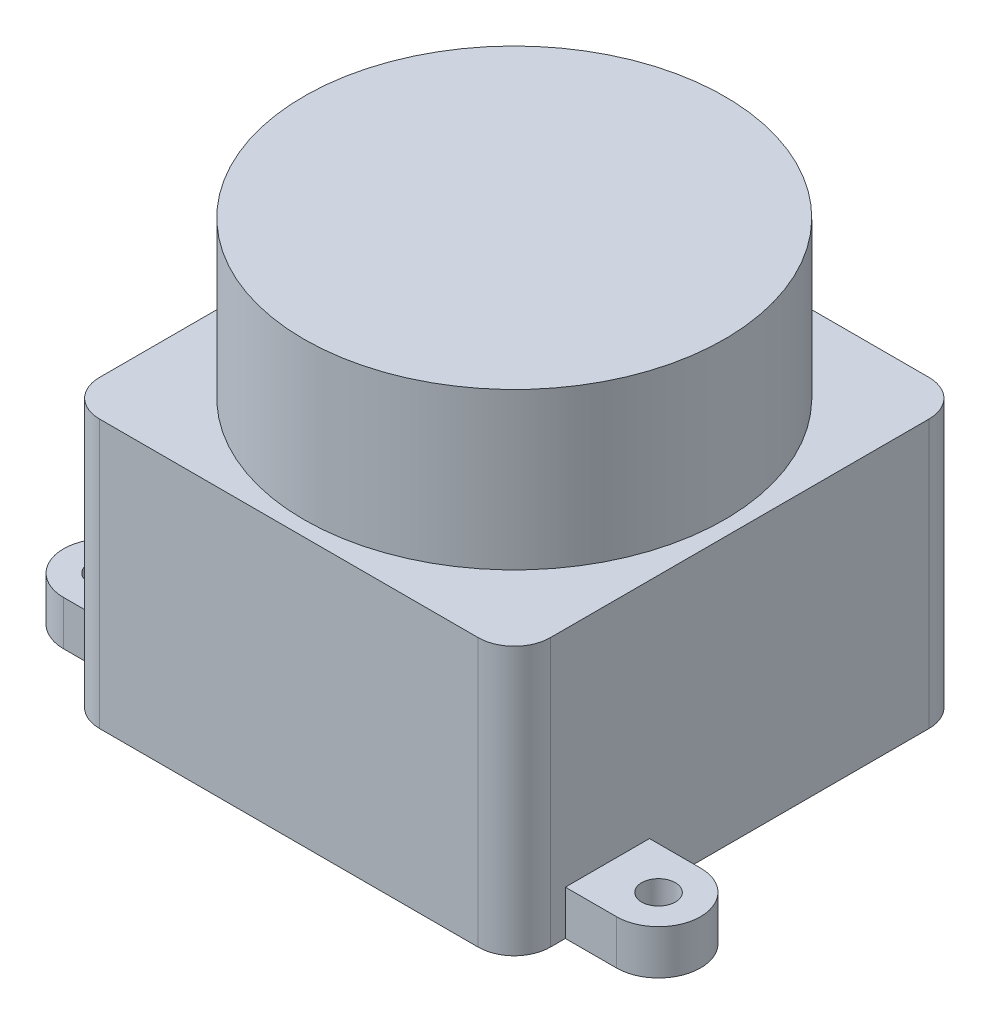
ISO-10303-21;
HEADER;
FILE_DESCRIPTION(('STEP AP214'),'2;1');
FILE_NAME('part.step','',(''),(''),'','','');
FILE_SCHEMA(('AUTOMOTIVE_DESIGN { 1 0 10303 214 1 1 1 1 }'));
ENDSEC;
DATA;
#1=APPLICATION_CONTEXT('core data for automotive mechanical design processes');
#2=APPLICATION_PROTOCOL_DEFINITION('international standard','automotive_design',2000,#1);
#3=PRODUCT_CONTEXT('',#1,'mechanical');
#4=PRODUCT('Part','Part','',(#3));
#5=PRODUCT_RELATED_PRODUCT_CATEGORY('part','',(#4));
#6=PRODUCT_DEFINITION_FORMATION('','',#4);
#7=PRODUCT_DEFINITION_CONTEXT('part definition',#1,'design');
#8=PRODUCT_DEFINITION('design','',#6,#7);
#9=PRODUCT_DEFINITION_SHAPE('','',#8);
#10=(LENGTH_UNIT() NAMED_UNIT(*) SI_UNIT(.MILLI.,.METRE.));
#11=(NAMED_UNIT(*) PLANE_ANGLE_UNIT() SI_UNIT($,.RADIAN.));
#12=(NAMED_UNIT(*) SI_UNIT($,.STERADIAN.) SOLID_ANGLE_UNIT());
#13=UNCERTAINTY_MEASURE_WITH_UNIT(LENGTH_MEASURE(1.E-05),#10,'distance_accuracy_value','');
#14=(GEOMETRIC_REPRESENTATION_CONTEXT(3) GLOBAL_UNCERTAINTY_ASSIGNED_CONTEXT((#13)) GLOBAL_UNIT_ASSIGNED_CONTEXT((#10,
#11,#12)) REPRESENTATION_CONTEXT('',''));
#15=CARTESIAN_POINT('',(0.,0.,0.));
#16=DIRECTION('',(0.,0.,1.));
#17=DIRECTION('',(1.,0.,0.));
#18=AXIS2_PLACEMENT_3D('',#15,#16,#17);
#19=CARTESIAN_POINT('',(18.75,22.3,18.75));
#20=DIRECTION('',(-1.,0.,0.));
#21=DIRECTION('',(0.,0.,1.));
#22=AXIS2_PLACEMENT_3D('',#19,#20,#21);
#23=PLANE('',#22);
#24=DIRECTION('',(0.,-1.,0.));
#25=VECTOR('',#24,1.);
#26=CARTESIAN_POINT('',(18.75,3.7,7.5));
#27=LINE('',#26,#25);
#28=CARTESIAN_POINT('',(18.75,3.7,7.5));
#29=VERTEX_POINT('',#28);
#30=CARTESIAN_POINT('',(18.75,0.,7.5));
#31=VERTEX_POINT('',#30);
#32=EDGE_CURVE('E230',#29,#31,#27,.T.);
#33=ORIENTED_EDGE('',*,*,#32,.T.);
#34=DIRECTION('',(0.,0.,-1.));
#35=VECTOR('',#34,1.);
#36=CARTESIAN_POINT('',(18.75,0.,18.75));
#37=LINE('',#36,#35);
#38=CARTESIAN_POINT('',(18.75,0.,-15.75));
#39=VERTEX_POINT('',#38);
#40=EDGE_CURVE('E247',#31,#39,#37,.T.);
#41=ORIENTED_EDGE('',*,*,#40,.T.);
#42=DIRECTION('',(0.,-1.,0.));
#43=VECTOR('',#42,1.);
#44=CARTESIAN_POINT('',(18.75,22.3,-15.75));
#45=LINE('',#44,#43);
#46=CARTESIAN_POINT('',(18.75,22.3,-15.75));
#47=VERTEX_POINT('',#46);
#48=EDGE_CURVE('E424',#39,#47,#45,.F.);
#49=ORIENTED_EDGE('',*,*,#48,.T.);
#50=DIRECTION('',(0.,0.,-1.));
#51=VECTOR('',#50,1.);
#52=CARTESIAN_POINT('',(18.75,22.3,18.75));
#53=LINE('',#52,#51);
#54=CARTESIAN_POINT('',(18.75,22.3,15.75));
#55=VERTEX_POINT('',#54);
#56=EDGE_CURVE('E368',#55,#47,#53,.T.);
#57=ORIENTED_EDGE('',*,*,#56,.F.);
#58=DIRECTION('',(0.,-1.,0.));
#59=VECTOR('',#58,1.);
#60=CARTESIAN_POINT('',(18.75,22.3,15.75));
#61=LINE('',#60,#59);
#62=CARTESIAN_POINT('',(18.75,0.,15.75));
#63=VERTEX_POINT('',#62);
#64=EDGE_CURVE('E420',#55,#63,#61,.T.);
#65=ORIENTED_EDGE('',*,*,#64,.T.);
#66=CARTESIAN_POINT('',(18.75,0.,14.5));
#67=VERTEX_POINT('',#66);
#68=EDGE_CURVE('E386',#63,#67,#37,.T.);
#69=ORIENTED_EDGE('',*,*,#68,.T.);
#70=DIRECTION('',(0.,-1.,0.));
#71=VECTOR('',#70,1.);
#72=CARTESIAN_POINT('',(18.75,3.7,14.5));
#73=LINE('',#72,#71);
#74=CARTESIAN_POINT('',(18.75,3.7,14.5));
#75=VERTEX_POINT('',#74);
#76=EDGE_CURVE('E98',#75,#67,#73,.T.);
#77=ORIENTED_EDGE('',*,*,#76,.F.);
#78=DIRECTION('',(0.,0.,1.));
#79=VECTOR('',#78,1.);
#80=CARTESIAN_POINT('',(18.75,3.7,0.));
#81=LINE('',#80,#79);
#82=EDGE_CURVE('E102',#29,#75,#81,.T.);
#83=ORIENTED_EDGE('',*,*,#82,.F.);
#84=EDGE_LOOP('',(#33,#41,#49,#57,#65,#69,#77,#83));
#85=FACE_BOUND('',#84,.T.);
#86=ADVANCED_FACE('F81',(#85),#23,.F.);
#87=CARTESIAN_POINT('',(-18.75,22.3,-18.75));
#88=DIRECTION('',(0.,0.,1.));
#89=DIRECTION('',(1.,0.,0.));
#90=AXIS2_PLACEMENT_3D('',#87,#88,#89);
#91=PLANE('',#90);
#92=DIRECTION('',(0.,-1.,0.));
#93=VECTOR('',#92,1.);
#94=CARTESIAN_POINT('',(-3.5,3.7,-18.75));
#95=LINE('',#94,#93);
#96=CARTESIAN_POINT('',(-3.5,3.7,-18.75));
#97=VERTEX_POINT('',#96);
#98=CARTESIAN_POINT('',(-3.5,0.,-18.75));
#99=VERTEX_POINT('',#98);
#100=EDGE_CURVE('E271',#97,#99,#95,.T.);
#101=ORIENTED_EDGE('',*,*,#100,.T.);
#102=DIRECTION('',(-1.,0.,0.));
#103=VECTOR('',#102,1.);
#104=CARTESIAN_POINT('',(-18.75,0.,-18.75));
#105=LINE('',#104,#103);
#106=CARTESIAN_POINT('',(-15.75,0.,-18.75));
#107=VERTEX_POINT('',#106);
#108=EDGE_CURVE('E389',#99,#107,#105,.T.);
#109=ORIENTED_EDGE('',*,*,#108,.T.);
#110=DIRECTION('',(0.,-1.,0.));
#111=VECTOR('',#110,1.);
#112=CARTESIAN_POINT('',(-15.75,22.3,-18.75));
#113=LINE('',#112,#111);
#114=CARTESIAN_POINT('',(-15.75,22.3,-18.75));
#115=VERTEX_POINT('',#114);
#116=EDGE_CURVE('E385',#107,#115,#113,.F.);
#117=ORIENTED_EDGE('',*,*,#116,.T.);
#118=DIRECTION('',(-1.,0.,0.));
#119=VECTOR('',#118,1.);
#120=CARTESIAN_POINT('',(-18.75,22.3,-18.75));
#121=LINE('',#120,#119);
#122=CARTESIAN_POINT('',(15.75,22.3,-18.75));
#123=VERTEX_POINT('',#122);
#124=EDGE_CURVE('E372',#123,#115,#121,.T.);
#125=ORIENTED_EDGE('',*,*,#124,.F.);
#126=DIRECTION('',(0.,-1.,0.));
#127=VECTOR('',#126,1.);
#128=CARTESIAN_POINT('',(15.75,22.3,-18.75));
#129=LINE('',#128,#127);
#130=CARTESIAN_POINT('',(15.75,0.,-18.75));
#131=VERTEX_POINT('',#130);
#132=EDGE_CURVE('E402',#123,#131,#129,.T.);
#133=ORIENTED_EDGE('',*,*,#132,.T.);
#134=CARTESIAN_POINT('',(3.5,0.,-18.75));
#135=VERTEX_POINT('',#134);
#136=EDGE_CURVE('E390',#131,#135,#105,.T.);
#137=ORIENTED_EDGE('',*,*,#136,.T.);
#138=DIRECTION('',(0.,-1.,0.));
#139=VECTOR('',#138,1.);
#140=CARTESIAN_POINT('',(3.5,3.7,-18.75));
#141=LINE('',#140,#139);
#142=CARTESIAN_POINT('',(3.5,3.7,-18.75));
#143=VERTEX_POINT('',#142);
#144=EDGE_CURVE('E267',#143,#135,#141,.T.);
#145=ORIENTED_EDGE('',*,*,#144,.F.);
#146=DIRECTION('',(1.,0.,0.));
#147=VECTOR('',#146,1.);
#148=CARTESIAN_POINT('',(0.,3.7,-18.75));
#149=LINE('',#148,#147);
#150=EDGE_CURVE('E300',#97,#143,#149,.T.);
#151=ORIENTED_EDGE('',*,*,#150,.F.);
#152=EDGE_LOOP('',(#101,#109,#117,#125,#133,#137,#145,#151));
#153=FACE_BOUND('',#152,.T.);
#154=ADVANCED_FACE('F472',(#153),#91,.F.);
#155=CARTESIAN_POINT('',(-18.75,22.3,18.75));
#156=DIRECTION('',(1.,0.,0.));
#157=DIRECTION('',(0.,0.,-1.));
#158=AXIS2_PLACEMENT_3D('',#155,#156,#157);
#159=PLANE('',#158);
#160=DIRECTION('',(0.,-1.,0.));
#161=VECTOR('',#160,1.);
#162=CARTESIAN_POINT('',(-18.75,3.7,14.5));
#163=LINE('',#162,#161);
#164=CARTESIAN_POINT('',(-18.75,3.7,14.5));
#165=VERTEX_POINT('',#164);
#166=CARTESIAN_POINT('',(-18.75,0.,14.5));
#167=VERTEX_POINT('',#166);
#168=EDGE_CURVE('E355',#165,#167,#163,.T.);
#169=ORIENTED_EDGE('',*,*,#168,.T.);
#170=DIRECTION('',(0.,0.,1.));
#171=VECTOR('',#170,1.);
#172=CARTESIAN_POINT('',(-18.75,0.,18.75));
#173=LINE('',#172,#171);
#174=CARTESIAN_POINT('',(-18.75,0.,15.75));
#175=VERTEX_POINT('',#174);
#176=EDGE_CURVE('E393',#167,#175,#173,.T.);
#177=ORIENTED_EDGE('',*,*,#176,.T.);
#178=DIRECTION('',(0.,-1.,0.));
#179=VECTOR('',#178,1.);
#180=CARTESIAN_POINT('',(-18.75,22.3,15.75));
#181=LINE('',#180,#179);
#182=CARTESIAN_POINT('',(-18.75,22.3,15.75));
#183=VERTEX_POINT('',#182);
#184=EDGE_CURVE('E439',#175,#183,#181,.F.);
#185=ORIENTED_EDGE('',*,*,#184,.T.);
#186=DIRECTION('',(0.,0.,1.));
#187=VECTOR('',#186,1.);
#188=CARTESIAN_POINT('',(-18.75,22.3,18.75));
#189=LINE('',#188,#187);
#190=CARTESIAN_POINT('',(-18.75,22.3,-15.75));
#191=VERTEX_POINT('',#190);
#192=EDGE_CURVE('E377',#191,#183,#189,.T.);
#193=ORIENTED_EDGE('',*,*,#192,.F.);
#194=DIRECTION('',(0.,-1.,0.));
#195=VECTOR('',#194,1.);
#196=CARTESIAN_POINT('',(-18.75,22.3,-15.75));
#197=LINE('',#196,#195);
#198=CARTESIAN_POINT('',(-18.75,0.,-15.75));
#199=VERTEX_POINT('',#198);
#200=EDGE_CURVE('E442',#191,#199,#197,.T.);
#201=ORIENTED_EDGE('',*,*,#200,.T.);
#202=CARTESIAN_POINT('',(-18.75,0.,7.5));
#203=VERTEX_POINT('',#202);
#204=EDGE_CURVE('E394',#199,#203,#173,.T.);
#205=ORIENTED_EDGE('',*,*,#204,.T.);
#206=DIRECTION('',(0.,-1.,0.));
#207=VECTOR('',#206,1.);
#208=CARTESIAN_POINT('',(-18.75,3.7,7.5));
#209=LINE('',#208,#207);
#210=CARTESIAN_POINT('',(-18.75,3.7,7.5));
#211=VERTEX_POINT('',#210);
#212=EDGE_CURVE('E359',#211,#203,#209,.T.);
#213=ORIENTED_EDGE('',*,*,#212,.F.);
#214=DIRECTION('',(0.,0.,-1.));
#215=VECTOR('',#214,1.);
#216=CARTESIAN_POINT('',(-18.75,3.7,0.));
#217=LINE('',#216,#215);
#218=EDGE_CURVE('E328',#165,#211,#217,.T.);
#219=ORIENTED_EDGE('',*,*,#218,.F.);
#220=EDGE_LOOP('',(#169,#177,#185,#193,#201,#205,#213,#219));
#221=FACE_BOUND('',#220,.T.);
#222=ADVANCED_FACE('F495',(#221),#159,.F.);
#223=CARTESIAN_POINT('',(-18.75,22.3,18.75));
#224=DIRECTION('',(0.,0.,-1.));
#225=DIRECTION('',(-1.,0.,0.));
#226=AXIS2_PLACEMENT_3D('',#223,#224,#225);
#227=PLANE('',#226);
#228=DIRECTION('',(1.,0.,0.));
#229=VECTOR('',#228,1.);
#230=CARTESIAN_POINT('',(-18.75,22.3,18.75));
#231=LINE('',#230,#229);
#232=CARTESIAN_POINT('',(-15.75,22.3,18.75));
#233=VERTEX_POINT('',#232);
#234=CARTESIAN_POINT('',(15.75,22.3,18.75));
#235=VERTEX_POINT('',#234);
#236=EDGE_CURVE('E381',#233,#235,#231,.T.);
#237=ORIENTED_EDGE('',*,*,#236,.F.);
#238=DIRECTION('',(0.,-1.,0.));
#239=VECTOR('',#238,1.);
#240=CARTESIAN_POINT('',(-15.75,22.3,18.75));
#241=LINE('',#240,#239);
#242=CARTESIAN_POINT('',(-15.75,0.,18.75));
#243=VERTEX_POINT('',#242);
#244=EDGE_CURVE('E85',#233,#243,#241,.T.);
#245=ORIENTED_EDGE('',*,*,#244,.T.);
#246=DIRECTION('',(1.,0.,0.));
#247=VECTOR('',#246,1.);
#248=CARTESIAN_POINT('',(-18.75,0.,18.75));
#249=LINE('',#248,#247);
#250=CARTESIAN_POINT('',(15.75,0.,18.75));
#251=VERTEX_POINT('',#250);
#252=EDGE_CURVE('E373',#243,#251,#249,.T.);
#253=ORIENTED_EDGE('',*,*,#252,.T.);
#254=DIRECTION('',(0.,-1.,0.));
#255=VECTOR('',#254,1.);
#256=CARTESIAN_POINT('',(15.75,22.3,18.75));
#257=LINE('',#256,#255);
#258=EDGE_CURVE('E445',#251,#235,#257,.F.);
#259=ORIENTED_EDGE('',*,*,#258,.T.);
#260=EDGE_LOOP('',(#237,#245,#253,#259));
#261=FACE_BOUND('',#260,.T.);
#262=ADVANCED_FACE('F454',(#261),#227,.F.);
#263=CARTESIAN_POINT('',(0.,22.3,0.));
#264=DIRECTION('',(0.,-1.,0.));
#265=DIRECTION('',(0.,0.,-1.));
#266=AXIS2_PLACEMENT_3D('',#263,#264,#265);
#267=PLANE('',#266);
#268=CARTESIAN_POINT('',(0.,22.3,0.));
#269=DIRECTION('',(0.,1.,0.));
#270=DIRECTION('',(0.,0.,1.));
#271=AXIS2_PLACEMENT_3D('',#268,#269,#270);
#272=CIRCLE('',#271,17.5);
#273=CARTESIAN_POINT('',(0.,22.3,17.5));
#274=VERTEX_POINT('',#273);
#275=EDGE_CURVE('E12',#274,#274,#272,.T.);
#276=ORIENTED_EDGE('',*,*,#275,.F.);
#277=EDGE_LOOP('',(#276));
#278=FACE_BOUND('',#277,.T.);
#279=ORIENTED_EDGE('',*,*,#56,.T.);
#280=CARTESIAN_POINT('',(15.75,22.3,-15.75));
#281=DIRECTION('',(0.,-1.,0.));
#282=DIRECTION('',(0.,0.,-1.));
#283=AXIS2_PLACEMENT_3D('',#280,#281,#282);
#284=CIRCLE('',#283,3.);
#285=EDGE_CURVE('E436',#47,#123,#284,.F.);
#286=ORIENTED_EDGE('',*,*,#285,.T.);
#287=ORIENTED_EDGE('',*,*,#124,.T.);
#288=CARTESIAN_POINT('',(-15.75,22.3,-15.75));
#289=DIRECTION('',(0.,-1.,0.));
#290=DIRECTION('',(0.,0.,-1.));
#291=AXIS2_PLACEMENT_3D('',#288,#289,#290);
#292=CIRCLE('',#291,3.);
#293=EDGE_CURVE('E433',#115,#191,#292,.F.);
#294=ORIENTED_EDGE('',*,*,#293,.T.);
#295=ORIENTED_EDGE('',*,*,#192,.T.);
#296=CARTESIAN_POINT('',(-15.75,22.3,15.75));
#297=DIRECTION('',(0.,-1.,0.));
#298=DIRECTION('',(0.,0.,-1.));
#299=AXIS2_PLACEMENT_3D('',#296,#297,#298);
#300=CIRCLE('',#299,3.);
#301=EDGE_CURVE('E430',#183,#233,#300,.F.);
#302=ORIENTED_EDGE('',*,*,#301,.T.);
#303=ORIENTED_EDGE('',*,*,#236,.T.);
#304=CARTESIAN_POINT('',(15.75,22.3,15.75));
#305=DIRECTION('',(0.,-1.,0.));
#306=DIRECTION('',(0.,0.,-1.));
#307=AXIS2_PLACEMENT_3D('',#304,#305,#306);
#308=CIRCLE('',#307,3.);
#309=EDGE_CURVE('E427',#235,#55,#308,.F.);
#310=ORIENTED_EDGE('',*,*,#309,.T.);
#311=EDGE_LOOP('',(#279,#286,#287,#294,#295,#302,#303,#310));
#312=FACE_BOUND('',#311,.T.);
#313=ADVANCED_FACE('F466',(#278,#312),#267,.F.);
#314=CARTESIAN_POINT('',(0.,0.,0.));
#315=DIRECTION('',(0.,-1.,0.));
#316=DIRECTION('',(0.,0.,-1.));
#317=AXIS2_PLACEMENT_3D('',#314,#315,#316);
#318=PLANE('',#317);
#319=ORIENTED_EDGE('',*,*,#136,.F.);
#320=CARTESIAN_POINT('',(15.75,0.,-15.75));
#321=DIRECTION('',(0.,-1.,0.));
#322=DIRECTION('',(0.,0.,-1.));
#323=AXIS2_PLACEMENT_3D('',#320,#321,#322);
#324=CIRCLE('',#323,3.);
#325=EDGE_CURVE('E417',#131,#39,#324,.T.);
#326=ORIENTED_EDGE('',*,*,#325,.T.);
#327=ORIENTED_EDGE('',*,*,#40,.F.);
#328=DIRECTION('',(-1.,0.,0.));
#329=VECTOR('',#328,1.);
#330=CARTESIAN_POINT('',(0.,0.,7.49999999999998));
#331=LINE('',#330,#329);
#332=CARTESIAN_POINT('',(23.,0.,7.50000000000001));
#333=VERTEX_POINT('',#332);
#334=EDGE_CURVE('E224',#333,#31,#331,.T.);
#335=ORIENTED_EDGE('',*,*,#334,.F.);
#336=CARTESIAN_POINT('',(23.,0.,11.));
#337=DIRECTION('',(0.,-1.,0.));
#338=DIRECTION('',(0.,0.,-1.));
#339=AXIS2_PLACEMENT_3D('',#336,#337,#338);
#340=CIRCLE('',#339,3.5);
#341=CARTESIAN_POINT('',(23.,0.,14.5));
#342=VERTEX_POINT('',#341);
#343=EDGE_CURVE('E233',#333,#342,#340,.T.);
#344=ORIENTED_EDGE('',*,*,#343,.T.);
#345=DIRECTION('',(-1.,0.,0.));
#346=VECTOR('',#345,1.);
#347=CARTESIAN_POINT('',(0.,0.,14.5));
#348=LINE('',#347,#346);
#349=EDGE_CURVE('E249',#342,#67,#348,.T.);
#350=ORIENTED_EDGE('',*,*,#349,.T.);
#351=ORIENTED_EDGE('',*,*,#68,.F.);
#352=CARTESIAN_POINT('',(15.75,0.,15.75));
#353=DIRECTION('',(0.,-1.,0.));
#354=DIRECTION('',(0.,0.,-1.));
#355=AXIS2_PLACEMENT_3D('',#352,#353,#354);
#356=CIRCLE('',#355,3.);
#357=EDGE_CURVE('E406',#63,#251,#356,.T.);
#358=ORIENTED_EDGE('',*,*,#357,.T.);
#359=ORIENTED_EDGE('',*,*,#252,.F.);
#360=CARTESIAN_POINT('',(-15.75,0.,15.75));
#361=DIRECTION('',(0.,-1.,0.));
#362=DIRECTION('',(0.,0.,-1.));
#363=AXIS2_PLACEMENT_3D('',#360,#361,#362);
#364=CIRCLE('',#363,3.);
#365=EDGE_CURVE('E409',#243,#175,#364,.T.);
#366=ORIENTED_EDGE('',*,*,#365,.T.);
#367=ORIENTED_EDGE('',*,*,#176,.F.);
#368=DIRECTION('',(1.,0.,0.));
#369=VECTOR('',#368,1.);
#370=CARTESIAN_POINT('',(0.,0.,14.5));
#371=LINE('',#370,#369);
#372=CARTESIAN_POINT('',(-23.,0.,14.5));
#373=VERTEX_POINT('',#372);
#374=EDGE_CURVE('E320',#373,#167,#371,.T.);
#375=ORIENTED_EDGE('',*,*,#374,.F.);
#376=CARTESIAN_POINT('',(-23.,0.,11.));
#377=DIRECTION('',(0.,-1.,0.));
#378=DIRECTION('',(0.,0.,-1.));
#379=AXIS2_PLACEMENT_3D('',#376,#377,#378);
#380=CIRCLE('',#379,3.5);
#381=CARTESIAN_POINT('',(-23.,0.,7.5));
#382=VERTEX_POINT('',#381);
#383=EDGE_CURVE('E340',#373,#382,#380,.T.);
#384=ORIENTED_EDGE('',*,*,#383,.T.);
#385=DIRECTION('',(1.,0.,0.));
#386=VECTOR('',#385,1.);
#387=CARTESIAN_POINT('',(0.,0.,7.5));
#388=LINE('',#387,#386);
#389=EDGE_CURVE('E344',#382,#203,#388,.T.);
#390=ORIENTED_EDGE('',*,*,#389,.T.);
#391=ORIENTED_EDGE('',*,*,#204,.F.);
#392=CARTESIAN_POINT('',(-15.75,0.,-15.75));
#393=DIRECTION('',(0.,-1.,0.));
#394=DIRECTION('',(0.,0.,-1.));
#395=AXIS2_PLACEMENT_3D('',#392,#393,#394);
#396=CIRCLE('',#395,3.);
#397=EDGE_CURVE('E413',#199,#107,#396,.T.);
#398=ORIENTED_EDGE('',*,*,#397,.T.);
#399=ORIENTED_EDGE('',*,*,#108,.F.);
#400=DIRECTION('',(0.,0.,1.));
#401=VECTOR('',#400,1.);
#402=CARTESIAN_POINT('',(-3.5,0.,0.));
#403=LINE('',#402,#401);
#404=CARTESIAN_POINT('',(-3.5,0.,-21.7261363439071));
#405=VERTEX_POINT('',#404);
#406=EDGE_CURVE('E279',#405,#99,#403,.T.);
#407=ORIENTED_EDGE('',*,*,#406,.F.);
#408=CARTESIAN_POINT('',(0.,0.,-21.7261363439071));
#409=DIRECTION('',(0.,-1.,0.));
#410=DIRECTION('',(0.,0.,-1.));
#411=AXIS2_PLACEMENT_3D('',#408,#409,#410);
#412=CIRCLE('',#411,3.5);
#413=CARTESIAN_POINT('',(3.5,0.,-21.7261363439071));
#414=VERTEX_POINT('',#413);
#415=EDGE_CURVE('E288',#405,#414,#412,.T.);
#416=ORIENTED_EDGE('',*,*,#415,.T.);
#417=DIRECTION('',(0.,0.,1.));
#418=VECTOR('',#417,1.);
#419=CARTESIAN_POINT('',(3.5,0.,0.));
#420=LINE('',#419,#418);
#421=EDGE_CURVE('E283',#414,#135,#420,.T.);
#422=ORIENTED_EDGE('',*,*,#421,.T.);
#423=EDGE_LOOP('',(#319,#326,#327,#335,#344,#350,#351,#358,#359,#366,#367,#375,#384,#390,#391,
#398,#399,#407,#416,#422));
#424=FACE_BOUND('',#423,.T.);
#425=CARTESIAN_POINT('',(-23.,0.,11.));
#426=DIRECTION('',(0.,-1.,0.));
#427=DIRECTION('',(0.,0.,-1.));
#428=AXIS2_PLACEMENT_3D('',#425,#426,#427);
#429=CIRCLE('',#428,1.4);
#430=CARTESIAN_POINT('',(-23.,0.,9.6));
#431=VERTEX_POINT('',#430);
#432=EDGE_CURVE('E296',#431,#431,#429,.T.);
#433=ORIENTED_EDGE('',*,*,#432,.F.);
#434=EDGE_LOOP('',(#433));
#435=FACE_BOUND('',#434,.T.);
#436=CARTESIAN_POINT('',(0.,0.,-21.7261363439071));
#437=DIRECTION('',(0.,-1.,0.));
#438=DIRECTION('',(0.,0.,-1.));
#439=AXIS2_PLACEMENT_3D('',#436,#437,#438);
#440=CIRCLE('',#439,1.4);
#441=CARTESIAN_POINT('',(0.,0.,-23.1261363439071));
#442=VERTEX_POINT('',#441);
#443=EDGE_CURVE('E292',#442,#442,#440,.T.);
#444=ORIENTED_EDGE('',*,*,#443,.F.);
#445=EDGE_LOOP('',(#444));
#446=FACE_BOUND('',#445,.T.);
#447=CARTESIAN_POINT('',(23.,0.,11.));
#448=DIRECTION('',(0.,-1.,0.));
#449=DIRECTION('',(0.,0.,-1.));
#450=AXIS2_PLACEMENT_3D('',#447,#448,#449);
#451=CIRCLE('',#450,1.4);
#452=CARTESIAN_POINT('',(23.,0.,9.6));
#453=VERTEX_POINT('',#452);
#454=EDGE_CURVE('E278',#453,#453,#451,.T.);
#455=ORIENTED_EDGE('',*,*,#454,.F.);
#456=EDGE_LOOP('',(#455));
#457=FACE_BOUND('',#456,.T.);
#458=ADVANCED_FACE('F244',(#424,#435,#446,#457),#318,.T.);
#459=CARTESIAN_POINT('',(15.75,22.3,-15.75));
#460=DIRECTION('',(0.,-1.,0.));
#461=DIRECTION('',(0.,0.,-1.));
#462=AXIS2_PLACEMENT_3D('',#459,#460,#461);
#463=CYLINDRICAL_SURFACE('',#462,3.);
#464=ORIENTED_EDGE('',*,*,#285,.F.);
#465=ORIENTED_EDGE('',*,*,#48,.F.);
#466=ORIENTED_EDGE('',*,*,#325,.F.);
#467=ORIENTED_EDGE('',*,*,#132,.F.);
#468=EDGE_LOOP('',(#464,#465,#466,#467));
#469=FACE_BOUND('',#468,.T.);
#470=ADVANCED_FACE('F470',(#469),#463,.T.);
#471=CARTESIAN_POINT('',(-15.75,22.3,-15.75));
#472=DIRECTION('',(0.,-1.,0.));
#473=DIRECTION('',(0.,0.,-1.));
#474=AXIS2_PLACEMENT_3D('',#471,#472,#473);
#475=CYLINDRICAL_SURFACE('',#474,3.);
#476=ORIENTED_EDGE('',*,*,#293,.F.);
#477=ORIENTED_EDGE('',*,*,#116,.F.);
#478=ORIENTED_EDGE('',*,*,#397,.F.);
#479=ORIENTED_EDGE('',*,*,#200,.F.);
#480=EDGE_LOOP('',(#476,#477,#478,#479));
#481=FACE_BOUND('',#480,.T.);
#482=ADVANCED_FACE('F492',(#481),#475,.T.);
#483=CARTESIAN_POINT('',(-15.75,22.3,15.75));
#484=DIRECTION('',(0.,-1.,0.));
#485=DIRECTION('',(0.,0.,-1.));
#486=AXIS2_PLACEMENT_3D('',#483,#484,#485);
#487=CYLINDRICAL_SURFACE('',#486,3.);
#488=ORIENTED_EDGE('',*,*,#301,.F.);
#489=ORIENTED_EDGE('',*,*,#184,.F.);
#490=ORIENTED_EDGE('',*,*,#365,.F.);
#491=ORIENTED_EDGE('',*,*,#244,.F.);
#492=EDGE_LOOP('',(#488,#489,#490,#491));
#493=FACE_BOUND('',#492,.T.);
#494=ADVANCED_FACE('F496',(#493),#487,.T.);
#495=CARTESIAN_POINT('',(15.75,22.3,15.75));
#496=DIRECTION('',(0.,-1.,0.));
#497=DIRECTION('',(0.,0.,-1.));
#498=AXIS2_PLACEMENT_3D('',#495,#496,#497);
#499=CYLINDRICAL_SURFACE('',#498,3.);
#500=ORIENTED_EDGE('',*,*,#309,.F.);
#501=ORIENTED_EDGE('',*,*,#258,.F.);
#502=ORIENTED_EDGE('',*,*,#357,.F.);
#503=ORIENTED_EDGE('',*,*,#64,.F.);
#504=EDGE_LOOP('',(#500,#501,#502,#503));
#505=FACE_BOUND('',#504,.T.);
#506=ADVANCED_FACE('F83',(#505),#499,.T.);
#507=CARTESIAN_POINT('',(0.,35.3,0.));
#508=DIRECTION('',(0.,-1.,0.));
#509=DIRECTION('',(0.,0.,-1.));
#510=AXIS2_PLACEMENT_3D('',#507,#508,#509);
#511=CYLINDRICAL_SURFACE('',#510,17.5);
#512=CARTESIAN_POINT('',(0.,35.3,0.));
#513=DIRECTION('',(0.,1.,0.));
#514=DIRECTION('',(0.,0.,1.));
#515=AXIS2_PLACEMENT_3D('',#512,#513,#514);
#516=CIRCLE('',#515,17.5);
#517=CARTESIAN_POINT('',(0.,35.3,17.5));
#518=VERTEX_POINT('',#517);
#519=EDGE_CURVE('E354',#518,#518,#516,.T.);
#520=ORIENTED_EDGE('',*,*,#519,.F.);
#521=EDGE_LOOP('',(#520));
#522=FACE_BOUND('',#521,.T.);
#523=ORIENTED_EDGE('',*,*,#275,.T.);
#524=EDGE_LOOP('',(#523));
#525=FACE_BOUND('',#524,.T.);
#526=ADVANCED_FACE('F502',(#522,#525),#511,.T.);
#527=CARTESIAN_POINT('',(0.,35.3,0.));
#528=DIRECTION('',(0.,1.,0.));
#529=DIRECTION('',(0.,0.,1.));
#530=AXIS2_PLACEMENT_3D('',#527,#528,#529);
#531=PLANE('',#530);
#532=ORIENTED_EDGE('',*,*,#519,.T.);
#533=EDGE_LOOP('',(#532));
#534=FACE_BOUND('',#533,.T.);
#535=ADVANCED_FACE('F553',(#534),#531,.T.);
#536=CARTESIAN_POINT('',(-23.,3.7,11.));
#537=DIRECTION('',(0.,-1.,0.));
#538=DIRECTION('',(0.,0.,-1.));
#539=AXIS2_PLACEMENT_3D('',#536,#537,#538);
#540=CYLINDRICAL_SURFACE('',#539,3.5);
#541=ORIENTED_EDGE('',*,*,#383,.F.);
#542=DIRECTION('',(0.,-1.,0.));
#543=VECTOR('',#542,1.);
#544=CARTESIAN_POINT('',(-23.,3.7,14.5));
#545=LINE('',#544,#543);
#546=CARTESIAN_POINT('',(-23.,3.7,14.5));
#547=VERTEX_POINT('',#546);
#548=EDGE_CURVE('E351',#547,#373,#545,.T.);
#549=ORIENTED_EDGE('',*,*,#548,.F.);
#550=CARTESIAN_POINT('',(-23.,3.7,11.));
#551=DIRECTION('',(0.,-1.,0.));
#552=DIRECTION('',(0.,0.,-1.));
#553=AXIS2_PLACEMENT_3D('',#550,#551,#552);
#554=CIRCLE('',#553,3.5);
#555=CARTESIAN_POINT('',(-23.,3.7,7.5));
#556=VERTEX_POINT('',#555);
#557=EDGE_CURVE('E319',#547,#556,#554,.T.);
#558=ORIENTED_EDGE('',*,*,#557,.T.);
#559=DIRECTION('',(0.,-1.,0.));
#560=VECTOR('',#559,1.);
#561=CARTESIAN_POINT('',(-23.,3.7,7.5));
#562=LINE('',#561,#560);
#563=EDGE_CURVE('E336',#556,#382,#562,.T.);
#564=ORIENTED_EDGE('',*,*,#563,.T.);
#565=EDGE_LOOP('',(#541,#549,#558,#564));
#566=FACE_BOUND('',#565,.T.);
#567=ADVANCED_FACE('F564',(#566),#540,.T.);
#568=CARTESIAN_POINT('',(0.,3.7,14.5));
#569=DIRECTION('',(0.,0.,-1.));
#570=DIRECTION('',(-1.,0.,0.));
#571=AXIS2_PLACEMENT_3D('',#568,#569,#570);
#572=PLANE('',#571);
#573=ORIENTED_EDGE('',*,*,#374,.T.);
#574=ORIENTED_EDGE('',*,*,#168,.F.);
#575=DIRECTION('',(1.,0.,0.));
#576=VECTOR('',#575,1.);
#577=CARTESIAN_POINT('',(0.,3.7,14.5));
#578=LINE('',#577,#576);
#579=EDGE_CURVE('E332',#547,#165,#578,.T.);
#580=ORIENTED_EDGE('',*,*,#579,.F.);
#581=ORIENTED_EDGE('',*,*,#548,.T.);
#582=EDGE_LOOP('',(#573,#574,#580,#581));
#583=FACE_BOUND('',#582,.T.);
#584=ADVANCED_FACE('F647',(#583),#572,.F.);
#585=CARTESIAN_POINT('',(-23.,3.7,11.));
#586=DIRECTION('',(0.,-1.,0.));
#587=DIRECTION('',(0.,0.,-1.));
#588=AXIS2_PLACEMENT_3D('',#585,#586,#587);
#589=CYLINDRICAL_SURFACE('',#588,1.4);
#590=CARTESIAN_POINT('',(-23.,3.7,11.));
#591=DIRECTION('',(0.,-1.,0.));
#592=DIRECTION('',(0.,0.,-1.));
#593=AXIS2_PLACEMENT_3D('',#590,#591,#592);
#594=CIRCLE('',#593,1.4);
#595=CARTESIAN_POINT('',(-23.,3.7,9.6));
#596=VERTEX_POINT('',#595);
#597=EDGE_CURVE('E315',#596,#596,#594,.T.);
#598=ORIENTED_EDGE('',*,*,#597,.F.);
#599=EDGE_LOOP('',(#598));
#600=FACE_BOUND('',#599,.T.);
#601=ORIENTED_EDGE('',*,*,#432,.T.);
#602=EDGE_LOOP('',(#601));
#603=FACE_BOUND('',#602,.T.);
#604=ADVANCED_FACE('F658',(#600,#603),#589,.F.);
#605=CARTESIAN_POINT('',(0.,3.7,7.5));
#606=DIRECTION('',(0.,0.,-1.));
#607=DIRECTION('',(-1.,0.,0.));
#608=AXIS2_PLACEMENT_3D('',#605,#606,#607);
#609=PLANE('',#608);
#610=ORIENTED_EDGE('',*,*,#389,.F.);
#611=ORIENTED_EDGE('',*,*,#563,.F.);
#612=DIRECTION('',(1.,0.,0.));
#613=VECTOR('',#612,1.);
#614=CARTESIAN_POINT('',(0.,3.7,7.5));
#615=LINE('',#614,#613);
#616=EDGE_CURVE('E324',#556,#211,#615,.T.);
#617=ORIENTED_EDGE('',*,*,#616,.T.);
#618=ORIENTED_EDGE('',*,*,#212,.T.);
#619=EDGE_LOOP('',(#610,#611,#617,#618));
#620=FACE_BOUND('',#619,.T.);
#621=ADVANCED_FACE('F669',(#620),#609,.T.);
#622=CARTESIAN_POINT('',(0.,3.7,0.));
#623=DIRECTION('',(0.,-1.,0.));
#624=DIRECTION('',(0.,0.,-1.));
#625=AXIS2_PLACEMENT_3D('',#622,#623,#624);
#626=PLANE('',#625);
#627=ORIENTED_EDGE('',*,*,#597,.T.);
#628=EDGE_LOOP('',(#627));
#629=FACE_BOUND('',#628,.T.);
#630=ORIENTED_EDGE('',*,*,#557,.F.);
#631=ORIENTED_EDGE('',*,*,#579,.T.);
#632=ORIENTED_EDGE('',*,*,#218,.T.);
#633=ORIENTED_EDGE('',*,*,#616,.F.);
#634=EDGE_LOOP('',(#630,#631,#632,#633));
#635=FACE_BOUND('',#634,.T.);
#636=ADVANCED_FACE('F680',(#629,#635),#626,.F.);
#637=CARTESIAN_POINT('',(0.,3.7,-21.7261363439071));
#638=DIRECTION('',(0.,-1.,0.));
#639=DIRECTION('',(0.,0.,-1.));
#640=AXIS2_PLACEMENT_3D('',#637,#638,#639);
#641=CYLINDRICAL_SURFACE('',#640,3.5);
#642=ORIENTED_EDGE('',*,*,#415,.F.);
#643=DIRECTION('',(0.,-1.,0.));
#644=VECTOR('',#643,1.);
#645=CARTESIAN_POINT('',(-3.5,3.7,-21.7261363439071));
#646=LINE('',#645,#644);
#647=CARTESIAN_POINT('',(-3.5,3.7,-21.7261363439071));
#648=VERTEX_POINT('',#647);
#649=EDGE_CURVE('E275',#648,#405,#646,.T.);
#650=ORIENTED_EDGE('',*,*,#649,.F.);
#651=CARTESIAN_POINT('',(0.,3.7,-21.7261363439071));
#652=DIRECTION('',(0.,-1.,0.));
#653=DIRECTION('',(0.,0.,-1.));
#654=AXIS2_PLACEMENT_3D('',#651,#652,#653);
#655=CIRCLE('',#654,3.5);
#656=CARTESIAN_POINT('',(3.5,3.7,-21.7261363439071));
#657=VERTEX_POINT('',#656);
#658=EDGE_CURVE('E308',#648,#657,#655,.T.);
#659=ORIENTED_EDGE('',*,*,#658,.T.);
#660=DIRECTION('',(0.,-1.,0.));
#661=VECTOR('',#660,1.);
#662=CARTESIAN_POINT('',(3.5,3.7,-21.7261363439071));
#663=LINE('',#662,#661);
#664=EDGE_CURVE('E263',#657,#414,#663,.T.);
#665=ORIENTED_EDGE('',*,*,#664,.T.);
#666=EDGE_LOOP('',(#642,#650,#659,#665));
#667=FACE_BOUND('',#666,.T.);
#668=ADVANCED_FACE('F691',(#667),#641,.T.);
#669=CARTESIAN_POINT('',(-3.5,3.7,0.));
#670=DIRECTION('',(1.,0.,0.));
#671=DIRECTION('',(0.,0.,-1.));
#672=AXIS2_PLACEMENT_3D('',#669,#670,#671);
#673=PLANE('',#672);
#674=ORIENTED_EDGE('',*,*,#406,.T.);
#675=ORIENTED_EDGE('',*,*,#100,.F.);
#676=DIRECTION('',(0.,0.,1.));
#677=VECTOR('',#676,1.);
#678=CARTESIAN_POINT('',(-3.5,3.7,0.));
#679=LINE('',#678,#677);
#680=EDGE_CURVE('E266',#648,#97,#679,.T.);
#681=ORIENTED_EDGE('',*,*,#680,.F.);
#682=ORIENTED_EDGE('',*,*,#649,.T.);
#683=EDGE_LOOP('',(#674,#675,#681,#682));
#684=FACE_BOUND('',#683,.T.);
#685=ADVANCED_FACE('F485',(#684),#673,.F.);
#686=CARTESIAN_POINT('',(0.,3.7,-21.7261363439071));
#687=DIRECTION('',(0.,-1.,0.));
#688=DIRECTION('',(0.,0.,-1.));
#689=AXIS2_PLACEMENT_3D('',#686,#687,#688);
#690=CYLINDRICAL_SURFACE('',#689,1.4);
#691=CARTESIAN_POINT('',(0.,3.7,-21.7261363439071));
#692=DIRECTION('',(0.,-1.,0.));
#693=DIRECTION('',(0.,0.,-1.));
#694=AXIS2_PLACEMENT_3D('',#691,#692,#693);
#695=CIRCLE('',#694,1.4);
#696=CARTESIAN_POINT('',(0.,3.7,-23.1261363439071));
#697=VERTEX_POINT('',#696);
#698=EDGE_CURVE('E284',#697,#697,#695,.T.);
#699=ORIENTED_EDGE('',*,*,#698,.F.);
#700=EDGE_LOOP('',(#699));
#701=FACE_BOUND('',#700,.T.);
#702=ORIENTED_EDGE('',*,*,#443,.T.);
#703=EDGE_LOOP('',(#702));
#704=FACE_BOUND('',#703,.T.);
#705=ADVANCED_FACE('F715',(#701,#704),#690,.F.);
#706=CARTESIAN_POINT('',(3.5,3.7,0.));
#707=DIRECTION('',(1.,0.,0.));
#708=DIRECTION('',(0.,0.,-1.));
#709=AXIS2_PLACEMENT_3D('',#706,#707,#708);
#710=PLANE('',#709);
#711=ORIENTED_EDGE('',*,*,#421,.F.);
#712=ORIENTED_EDGE('',*,*,#664,.F.);
#713=DIRECTION('',(0.,0.,1.));
#714=VECTOR('',#713,1.);
#715=CARTESIAN_POINT('',(3.5,3.7,0.));
#716=LINE('',#715,#714);
#717=EDGE_CURVE('E304',#657,#143,#716,.T.);
#718=ORIENTED_EDGE('',*,*,#717,.T.);
#719=ORIENTED_EDGE('',*,*,#144,.T.);
#720=EDGE_LOOP('',(#711,#712,#718,#719));
#721=FACE_BOUND('',#720,.T.);
#722=ADVANCED_FACE('F477',(#721),#710,.T.);
#723=CARTESIAN_POINT('',(0.,3.7,0.));
#724=DIRECTION('',(0.,-1.,0.));
#725=DIRECTION('',(0.,0.,-1.));
#726=AXIS2_PLACEMENT_3D('',#723,#724,#725);
#727=PLANE('',#726);
#728=ORIENTED_EDGE('',*,*,#698,.T.);
#729=EDGE_LOOP('',(#728));
#730=FACE_BOUND('',#729,.T.);
#731=ORIENTED_EDGE('',*,*,#658,.F.);
#732=ORIENTED_EDGE('',*,*,#680,.T.);
#733=ORIENTED_EDGE('',*,*,#150,.T.);
#734=ORIENTED_EDGE('',*,*,#717,.F.);
#735=EDGE_LOOP('',(#731,#732,#733,#734));
#736=FACE_BOUND('',#735,.T.);
#737=ADVANCED_FACE('F481',(#730,#736),#727,.F.);
#738=CARTESIAN_POINT('',(0.,3.7,7.49999999999998));
#739=DIRECTION('',(0.,0.,1.));
#740=DIRECTION('',(1.,0.,0.));
#741=AXIS2_PLACEMENT_3D('',#738,#739,#740);
#742=PLANE('',#741);
#743=ORIENTED_EDGE('',*,*,#334,.T.);
#744=ORIENTED_EDGE('',*,*,#32,.F.);
#745=DIRECTION('',(-1.,0.,0.));
#746=VECTOR('',#745,1.);
#747=CARTESIAN_POINT('',(0.,3.7,7.49999999999998));
#748=LINE('',#747,#746);
#749=CARTESIAN_POINT('',(23.,3.7,7.50000000000001));
#750=VERTEX_POINT('',#749);
#751=EDGE_CURVE('E225',#750,#29,#748,.T.);
#752=ORIENTED_EDGE('',*,*,#751,.F.);
#753=DIRECTION('',(0.,-1.,0.));
#754=VECTOR('',#753,1.);
#755=CARTESIAN_POINT('',(23.,3.7,7.50000000000001));
#756=LINE('',#755,#754);
#757=EDGE_CURVE('E219',#750,#333,#756,.T.);
#758=ORIENTED_EDGE('',*,*,#757,.T.);
#759=EDGE_LOOP('',(#743,#744,#752,#758));
#760=FACE_BOUND('',#759,.T.);
#761=ADVANCED_FACE('F221',(#760),#742,.F.);
#762=CARTESIAN_POINT('',(0.,3.7,14.5));
#763=DIRECTION('',(0.,0.,1.));
#764=DIRECTION('',(1.,0.,0.));
#765=AXIS2_PLACEMENT_3D('',#762,#763,#764);
#766=PLANE('',#765);
#767=ORIENTED_EDGE('',*,*,#349,.F.);
#768=DIRECTION('',(0.,-1.,0.));
#769=VECTOR('',#768,1.);
#770=CARTESIAN_POINT('',(23.,3.7,14.5));
#771=LINE('',#770,#769);
#772=CARTESIAN_POINT('',(23.,3.7,14.5));
#773=VERTEX_POINT('',#772);
#774=EDGE_CURVE('E235',#773,#342,#771,.T.);
#775=ORIENTED_EDGE('',*,*,#774,.F.);
#776=DIRECTION('',(-1.,0.,0.));
#777=VECTOR('',#776,1.);
#778=CARTESIAN_POINT('',(0.,3.7,14.5));
#779=LINE('',#778,#777);
#780=EDGE_CURVE('E250',#773,#75,#779,.T.);
#781=ORIENTED_EDGE('',*,*,#780,.T.);
#782=ORIENTED_EDGE('',*,*,#76,.T.);
#783=EDGE_LOOP('',(#767,#775,#781,#782));
#784=FACE_BOUND('',#783,.T.);
#785=ADVANCED_FACE('F760',(#784),#766,.T.);
#786=CARTESIAN_POINT('',(0.,3.7,0.));
#787=DIRECTION('',(0.,-1.,0.));
#788=DIRECTION('',(0.,0.,-1.));
#789=AXIS2_PLACEMENT_3D('',#786,#787,#788);
#790=PLANE('',#789);
#791=ORIENTED_EDGE('',*,*,#780,.F.);
#792=CARTESIAN_POINT('',(23.,3.7,11.));
#793=DIRECTION('',(0.,-1.,0.));
#794=DIRECTION('',(0.,0.,-1.));
#795=AXIS2_PLACEMENT_3D('',#792,#793,#794);
#796=CIRCLE('',#795,3.5);
#797=EDGE_CURVE('E241',#750,#773,#796,.T.);
#798=ORIENTED_EDGE('',*,*,#797,.F.);
#799=ORIENTED_EDGE('',*,*,#751,.T.);
#800=ORIENTED_EDGE('',*,*,#82,.T.);
#801=EDGE_LOOP('',(#791,#798,#799,#800));
#802=FACE_BOUND('',#801,.T.);
#803=CARTESIAN_POINT('',(23.,3.7,11.));
#804=DIRECTION('',(0.,-1.,0.));
#805=DIRECTION('',(0.,0.,-1.));
#806=AXIS2_PLACEMENT_3D('',#803,#804,#805);
#807=CIRCLE('',#806,1.4);
#808=CARTESIAN_POINT('',(23.,3.7,9.6));
#809=VERTEX_POINT('',#808);
#810=EDGE_CURVE('E240',#809,#809,#807,.T.);
#811=ORIENTED_EDGE('',*,*,#810,.T.);
#812=EDGE_LOOP('',(#811));
#813=FACE_BOUND('',#812,.T.);
#814=ADVANCED_FACE('F771',(#802,#813),#790,.F.);
#815=CARTESIAN_POINT('',(23.,3.7,11.));
#816=DIRECTION('',(0.,-1.,0.));
#817=DIRECTION('',(0.,0.,-1.));
#818=AXIS2_PLACEMENT_3D('',#815,#816,#817);
#819=CYLINDRICAL_SURFACE('',#818,3.5);
#820=ORIENTED_EDGE('',*,*,#757,.F.);
#821=ORIENTED_EDGE('',*,*,#797,.T.);
#822=ORIENTED_EDGE('',*,*,#774,.T.);
#823=ORIENTED_EDGE('',*,*,#343,.F.);
#824=EDGE_LOOP('',(#820,#821,#822,#823));
#825=FACE_BOUND('',#824,.T.);
#826=ADVANCED_FACE('F234',(#825),#819,.T.);
#827=CARTESIAN_POINT('',(23.,3.7,11.));
#828=DIRECTION('',(0.,-1.,0.));
#829=DIRECTION('',(0.,0.,-1.));
#830=AXIS2_PLACEMENT_3D('',#827,#828,#829);
#831=CYLINDRICAL_SURFACE('',#830,1.4);
#832=ORIENTED_EDGE('',*,*,#810,.F.);
#833=EDGE_LOOP('',(#832));
#834=FACE_BOUND('',#833,.T.);
#835=ORIENTED_EDGE('',*,*,#454,.T.);
#836=EDGE_LOOP('',(#835));
#837=FACE_BOUND('',#836,.T.);
#838=ADVANCED_FACE('F762',(#834,#837),#831,.F.);
#839=CLOSED_SHELL('',(#86,#154,#222,#262,#313,#458,#470,#482,#494,#506,#526,#535,#567,#584,#604,
#621,#636,#668,#685,#705,#722,#737,#761,#785,#814,#826,#838));
#840=MANIFOLD_SOLID_BREP('B2',#839);
#841=ADVANCED_BREP_SHAPE_REPRESENTATION('',(#18,#840),#14);
#842=SHAPE_DEFINITION_REPRESENTATION(#9,#841);
ENDSEC;
END-ISO-10303-21;
